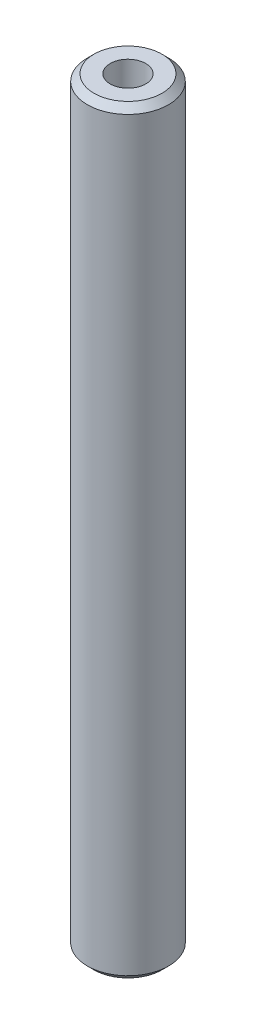
ISO-10303-21;
HEADER;
FILE_DESCRIPTION(('STEP AP214'),'2;1');
FILE_NAME('part.step','',(''),(''),'','','');
FILE_SCHEMA(('AUTOMOTIVE_DESIGN { 1 0 10303 214 1 1 1 1 }'));
ENDSEC;
DATA;
#1=APPLICATION_CONTEXT('core data for automotive mechanical design processes');
#2=APPLICATION_PROTOCOL_DEFINITION('international standard','automotive_design',2000,#1);
#3=PRODUCT_CONTEXT('',#1,'mechanical');
#4=PRODUCT('Part','Part','',(#3));
#5=PRODUCT_RELATED_PRODUCT_CATEGORY('part','',(#4));
#6=PRODUCT_DEFINITION_FORMATION('','',#4);
#7=PRODUCT_DEFINITION_CONTEXT('part definition',#1,'design');
#8=PRODUCT_DEFINITION('design','',#6,#7);
#9=PRODUCT_DEFINITION_SHAPE('','',#8);
#10=(LENGTH_UNIT() NAMED_UNIT(*) SI_UNIT(.MILLI.,.METRE.));
#11=(NAMED_UNIT(*) PLANE_ANGLE_UNIT() SI_UNIT($,.RADIAN.));
#12=(NAMED_UNIT(*) SI_UNIT($,.STERADIAN.) SOLID_ANGLE_UNIT());
#13=UNCERTAINTY_MEASURE_WITH_UNIT(LENGTH_MEASURE(1.E-05),#10,'distance_accuracy_value','');
#14=(GEOMETRIC_REPRESENTATION_CONTEXT(3) GLOBAL_UNCERTAINTY_ASSIGNED_CONTEXT((#13)) GLOBAL_UNIT_ASSIGNED_CONTEXT((#10,
#11,#12)) REPRESENTATION_CONTEXT('',''));
#15=CARTESIAN_POINT('',(0.,0.,0.));
#16=DIRECTION('',(0.,0.,1.));
#17=DIRECTION('',(1.,0.,0.));
#18=AXIS2_PLACEMENT_3D('',#15,#16,#17);
#19=CARTESIAN_POINT('',(0.,140.394431057898,0.));
#20=DIRECTION('',(0.,-1.,0.));
#21=DIRECTION('',(0.,0.,-1.));
#22=AXIS2_PLACEMENT_3D('',#19,#20,#21);
#23=CYLINDRICAL_SURFACE('',#22,7.5);
#24=CARTESIAN_POINT('',(0.,139.172403777292,0.));
#25=DIRECTION('',(0.,1.,0.));
#26=DIRECTION('',(0.,0.,1.));
#27=AXIS2_PLACEMENT_3D('',#24,#25,#26);
#28=CIRCLE('',#27,7.5);
#29=CARTESIAN_POINT('',(0.,139.172403777292,7.5));
#30=VERTEX_POINT('',#29);
#31=EDGE_CURVE('E50',#30,#30,#28,.F.);
#32=ORIENTED_EDGE('',*,*,#31,.T.);
#33=EDGE_LOOP('',(#32));
#34=FACE_BOUND('',#33,.T.);
#35=CARTESIAN_POINT('',(0.,1.22202728060514,0.));
#36=DIRECTION('',(0.,1.,0.));
#37=DIRECTION('',(0.,0.,1.));
#38=AXIS2_PLACEMENT_3D('',#35,#36,#37);
#39=CIRCLE('',#38,7.5);
#40=CARTESIAN_POINT('',(0.,1.22202728060514,7.5));
#41=VERTEX_POINT('',#40);
#42=EDGE_CURVE('E51',#41,#41,#39,.T.);
#43=ORIENTED_EDGE('',*,*,#42,.T.);
#44=EDGE_LOOP('',(#43));
#45=FACE_BOUND('',#44,.T.);
#46=ADVANCED_FACE('F39',(#34,#45),#23,.T.);
#47=CARTESIAN_POINT('',(0.,140.394431057898,0.));
#48=DIRECTION('',(0.,1.,0.));
#49=DIRECTION('',(0.,0.,1.));
#50=AXIS2_PLACEMENT_3D('',#47,#48,#49);
#51=PLANE('',#50);
#52=CARTESIAN_POINT('',(0.,140.394431057898,0.));
#53=DIRECTION('',(0.,1.,0.));
#54=DIRECTION('',(0.,0.,1.));
#55=AXIS2_PLACEMENT_3D('',#52,#53,#54);
#56=CIRCLE('',#55,6.27797271939486);
#57=CARTESIAN_POINT('',(0.,140.394431057898,6.27797271939486));
#58=VERTEX_POINT('',#57);
#59=EDGE_CURVE('E54',#58,#58,#56,.T.);
#60=ORIENTED_EDGE('',*,*,#59,.T.);
#61=EDGE_LOOP('',(#60));
#62=FACE_BOUND('',#61,.T.);
#63=CARTESIAN_POINT('',(0.,140.394431057898,0.));
#64=DIRECTION('',(0.,1.,0.));
#65=DIRECTION('',(0.,0.,1.));
#66=AXIS2_PLACEMENT_3D('',#63,#64,#65);
#67=CIRCLE('',#66,3.28657122197777);
#68=CARTESIAN_POINT('',(0.,140.394431057898,3.28657122197777));
#69=VERTEX_POINT('',#68);
#70=EDGE_CURVE('E58',#69,#69,#67,.T.);
#71=ORIENTED_EDGE('',*,*,#70,.F.);
#72=EDGE_LOOP('',(#71));
#73=FACE_BOUND('',#72,.T.);
#74=ADVANCED_FACE('F69',(#62,#73),#51,.T.);
#75=CARTESIAN_POINT('',(0.,0.,0.));
#76=DIRECTION('',(0.,1.,0.));
#77=DIRECTION('',(0.,0.,1.));
#78=AXIS2_PLACEMENT_3D('',#75,#76,#77);
#79=PLANE('',#78);
#80=CARTESIAN_POINT('',(0.,0.,0.));
#81=DIRECTION('',(0.,1.,0.));
#82=DIRECTION('',(0.,0.,1.));
#83=AXIS2_PLACEMENT_3D('',#80,#81,#82);
#84=CIRCLE('',#83,6.27797271939484);
#85=CARTESIAN_POINT('',(0.,0.,6.27797271939484));
#86=VERTEX_POINT('',#85);
#87=EDGE_CURVE('E10',#86,#86,#84,.F.);
#88=ORIENTED_EDGE('',*,*,#87,.T.);
#89=EDGE_LOOP('',(#88));
#90=FACE_BOUND('',#89,.T.);
#91=CARTESIAN_POINT('',(0.,0.,0.));
#92=DIRECTION('',(0.,1.,0.));
#93=DIRECTION('',(0.,0.,1.));
#94=AXIS2_PLACEMENT_3D('',#91,#92,#93);
#95=CIRCLE('',#94,3.28657122197777);
#96=CARTESIAN_POINT('',(0.,0.,3.28657122197777));
#97=VERTEX_POINT('',#96);
#98=EDGE_CURVE('E63',#97,#97,#95,.T.);
#99=ORIENTED_EDGE('',*,*,#98,.T.);
#100=EDGE_LOOP('',(#99));
#101=FACE_BOUND('',#100,.T.);
#102=ADVANCED_FACE('F75',(#90,#101),#79,.F.);
#103=CARTESIAN_POINT('',(0.,140.394431057898,0.));
#104=DIRECTION('',(0.,-1.,0.));
#105=DIRECTION('',(0.,0.,-1.));
#106=AXIS2_PLACEMENT_3D('',#103,#104,#105);
#107=CYLINDRICAL_SURFACE('',#106,3.28657122197777);
#108=ORIENTED_EDGE('',*,*,#70,.T.);
#109=EDGE_LOOP('',(#108));
#110=FACE_BOUND('',#109,.T.);
#111=ORIENTED_EDGE('',*,*,#98,.F.);
#112=EDGE_LOOP('',(#111));
#113=FACE_BOUND('',#112,.T.);
#114=ADVANCED_FACE('F70',(#110,#113),#107,.F.);
#115=CARTESIAN_POINT('',(0.,140.394431057898,0.));
#116=DIRECTION('',(0.,-1.,0.));
#117=DIRECTION('',(0.,0.,-1.));
#118=AXIS2_PLACEMENT_3D('',#115,#116,#117);
#119=CONICAL_SURFACE('',#118,6.27797271939486,0.78539816339744);
#120=ORIENTED_EDGE('',*,*,#31,.F.);
#121=EDGE_LOOP('',(#120));
#122=FACE_BOUND('',#121,.T.);
#123=ORIENTED_EDGE('',*,*,#59,.F.);
#124=EDGE_LOOP('',(#123));
#125=FACE_BOUND('',#124,.T.);
#126=ADVANCED_FACE('F81',(#122,#125),#119,.T.);
#127=CARTESIAN_POINT('',(0.,1.22202728060514,0.));
#128=DIRECTION('',(0.,1.,0.));
#129=DIRECTION('',(0.,0.,1.));
#130=AXIS2_PLACEMENT_3D('',#127,#128,#129);
#131=CONICAL_SURFACE('',#130,7.5,0.785398163397457);
#132=ORIENTED_EDGE('',*,*,#87,.F.);
#133=EDGE_LOOP('',(#132));
#134=FACE_BOUND('',#133,.T.);
#135=ORIENTED_EDGE('',*,*,#42,.F.);
#136=EDGE_LOOP('',(#135));
#137=FACE_BOUND('',#136,.T.);
#138=ADVANCED_FACE('F45',(#134,#137),#131,.T.);
#139=CLOSED_SHELL('',(#46,#74,#102,#114,#126,#138));
#140=MANIFOLD_SOLID_BREP('B2',#139);
#141=ADVANCED_BREP_SHAPE_REPRESENTATION('',(#18,#140),#14);
#142=SHAPE_DEFINITION_REPRESENTATION(#9,#141);
ENDSEC;
END-ISO-10303-21;
